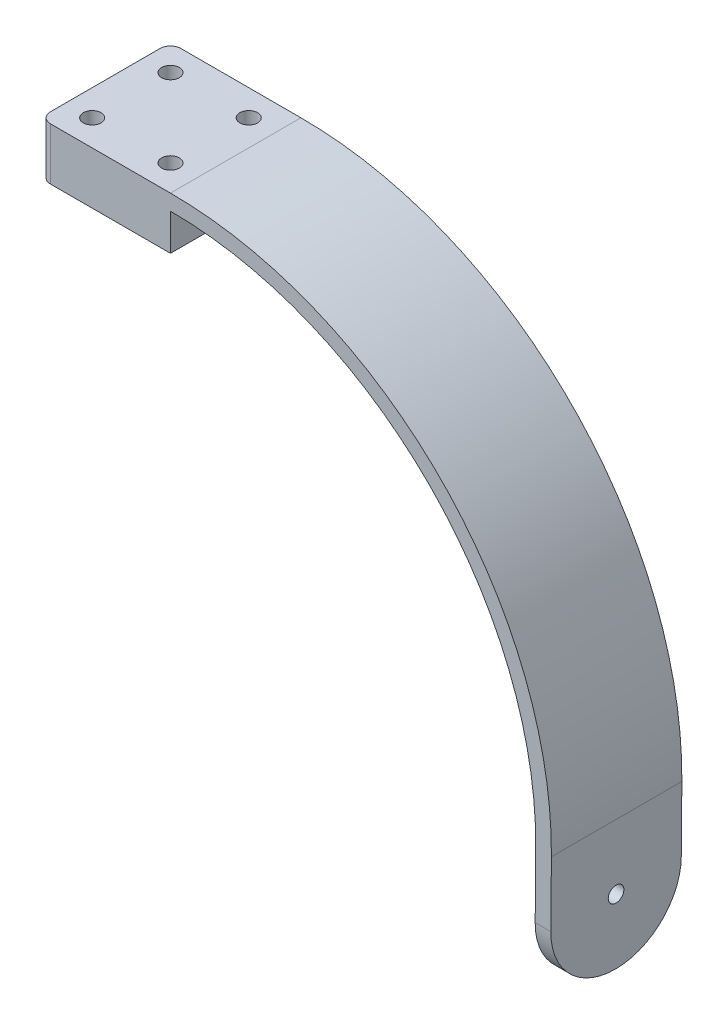
ISO-10303-21;
HEADER;
FILE_DESCRIPTION(('STEP AP214'),'2;1');
FILE_NAME('part.step','',(''),(''),'','','');
FILE_SCHEMA(('AUTOMOTIVE_DESIGN { 1 0 10303 214 1 1 1 1 }'));
ENDSEC;
DATA;
#1=APPLICATION_CONTEXT('core data for automotive mechanical design processes');
#2=APPLICATION_PROTOCOL_DEFINITION('international standard','automotive_design',2000,#1);
#3=PRODUCT_CONTEXT('',#1,'mechanical');
#4=PRODUCT('Part','Part','',(#3));
#5=PRODUCT_RELATED_PRODUCT_CATEGORY('part','',(#4));
#6=PRODUCT_DEFINITION_FORMATION('','',#4);
#7=PRODUCT_DEFINITION_CONTEXT('part definition',#1,'design');
#8=PRODUCT_DEFINITION('design','',#6,#7);
#9=PRODUCT_DEFINITION_SHAPE('','',#8);
#10=(LENGTH_UNIT() NAMED_UNIT(*) SI_UNIT(.MILLI.,.METRE.));
#11=(NAMED_UNIT(*) PLANE_ANGLE_UNIT() SI_UNIT($,.RADIAN.));
#12=(NAMED_UNIT(*) SI_UNIT($,.STERADIAN.) SOLID_ANGLE_UNIT());
#13=UNCERTAINTY_MEASURE_WITH_UNIT(LENGTH_MEASURE(1.E-05),#10,'distance_accuracy_value','');
#14=(GEOMETRIC_REPRESENTATION_CONTEXT(3) GLOBAL_UNCERTAINTY_ASSIGNED_CONTEXT((#13)) GLOBAL_UNIT_ASSIGNED_CONTEXT((#10,
#11,#12)) REPRESENTATION_CONTEXT('',''));
#15=CARTESIAN_POINT('',(0.,0.,0.));
#16=DIRECTION('',(0.,0.,1.));
#17=DIRECTION('',(1.,0.,0.));
#18=AXIS2_PLACEMENT_3D('',#15,#16,#17);
#19=CARTESIAN_POINT('',(0.,0.,25.));
#20=DIRECTION('',(0.,0.,-1.));
#21=DIRECTION('',(-1.,0.,0.));
#22=AXIS2_PLACEMENT_3D('',#19,#20,#21);
#23=CYLINDRICAL_SURFACE('',#22,70.);
#24=CARTESIAN_POINT('',(0.,0.,0.));
#25=DIRECTION('',(0.,0.,-1.));
#26=DIRECTION('',(-1.,0.,0.));
#27=AXIS2_PLACEMENT_3D('',#24,#25,#26);
#28=CIRCLE('',#27,70.);
#29=CARTESIAN_POINT('',(0.,70.,0.));
#30=VERTEX_POINT('',#29);
#31=CARTESIAN_POINT('',(69.997334614492,-0.610857484886409,0.));
#32=VERTEX_POINT('',#31);
#33=EDGE_CURVE('E152',#30,#32,#28,.T.);
#34=ORIENTED_EDGE('',*,*,#33,.T.);
#35=DIRECTION('',(0.,0.,-1.));
#36=VECTOR('',#35,1.);
#37=CARTESIAN_POINT('',(69.997334614492,-0.610857484886409,25.));
#38=LINE('',#37,#36);
#39=CARTESIAN_POINT('',(69.997334614492,-0.610857484886409,25.));
#40=VERTEX_POINT('',#39);
#41=EDGE_CURVE('E227',#40,#32,#38,.T.);
#42=ORIENTED_EDGE('',*,*,#41,.F.);
#43=CARTESIAN_POINT('',(0.,0.,25.));
#44=DIRECTION('',(0.,0.,-1.));
#45=DIRECTION('',(-1.,0.,0.));
#46=AXIS2_PLACEMENT_3D('',#43,#44,#45);
#47=CIRCLE('',#46,70.);
#48=CARTESIAN_POINT('',(0.,70.,25.));
#49=VERTEX_POINT('',#48);
#50=EDGE_CURVE('E180',#49,#40,#47,.T.);
#51=ORIENTED_EDGE('',*,*,#50,.F.);
#52=DIRECTION('',(0.,0.,-1.));
#53=VECTOR('',#52,1.);
#54=CARTESIAN_POINT('',(0.,70.,25.));
#55=LINE('',#54,#53);
#56=EDGE_CURVE('E199',#49,#30,#55,.T.);
#57=ORIENTED_EDGE('',*,*,#56,.T.);
#58=EDGE_LOOP('',(#34,#42,#51,#57));
#59=FACE_BOUND('',#58,.T.);
#60=ADVANCED_FACE('F45',(#59),#23,.F.);
#61=CARTESIAN_POINT('',(69.997334614492,-0.610857484886409,25.));
#62=DIRECTION('',(0.999961923064171,-0.00872653549837676,0.));
#63=DIRECTION('',(0.00872653549837677,0.999961923064171,0.));
#64=AXIS2_PLACEMENT_3D('',#61,#62,#63);
#65=PLANE('',#64);
#66=CARTESIAN_POINT('',(69.8882529207623,-13.1103815231885,12.5));
#67=DIRECTION('',(0.999961923064171,-0.00872653549837676,0.));
#68=DIRECTION('',(0.00872653549837677,0.999961923064171,0.));
#69=AXIS2_PLACEMENT_3D('',#66,#67,#68);
#70=CIRCLE('',#69,1.5);
#71=CARTESIAN_POINT('',(69.9013427240098,-11.6104386385922,12.5));
#72=VERTEX_POINT('',#71);
#73=EDGE_CURVE('E176',#72,#72,#70,.F.);
#74=ORIENTED_EDGE('',*,*,#73,.F.);
#75=EDGE_LOOP('',(#74));
#76=FACE_BOUND('',#75,.T.);
#77=DIRECTION('',(-0.00872653549837676,-0.999961923064171,0.));
#78=VECTOR('',#77,1.);
#79=CARTESIAN_POINT('',(69.997334614492,-0.610857484886409,0.));
#80=LINE('',#79,#78);
#81=CARTESIAN_POINT('',(69.8882529207623,-13.1103815231885,0.));
#82=VERTEX_POINT('',#81);
#83=EDGE_CURVE('E202',#32,#82,#80,.T.);
#84=ORIENTED_EDGE('',*,*,#83,.T.);
#85=CARTESIAN_POINT('',(69.8882529207623,-13.1103815231885,12.5));
#86=DIRECTION('',(0.999961923064171,-0.00872653549837676,0.));
#87=DIRECTION('',(0.00872653549837677,0.999961923064171,0.));
#88=AXIS2_PLACEMENT_3D('',#85,#86,#87);
#89=CIRCLE('',#88,12.5);
#90=CARTESIAN_POINT('',(69.7791712270326,-25.6099055614907,12.5));
#91=VERTEX_POINT('',#90);
#92=EDGE_CURVE('E244',#82,#91,#89,.F.);
#93=ORIENTED_EDGE('',*,*,#92,.T.);
#94=CARTESIAN_POINT('',(69.8882529207623,-13.1103815231886,12.5));
#95=DIRECTION('',(0.999961923064171,-0.00872653549837676,0.));
#96=DIRECTION('',(0.00872653549837677,0.999961923064171,0.));
#97=AXIS2_PLACEMENT_3D('',#94,#95,#96);
#98=CIRCLE('',#97,12.5);
#99=CARTESIAN_POINT('',(69.8882529207623,-13.1103815231885,25.));
#100=VERTEX_POINT('',#99);
#101=EDGE_CURVE('E241',#91,#100,#98,.F.);
#102=ORIENTED_EDGE('',*,*,#101,.T.);
#103=DIRECTION('',(-0.00872653549837676,-0.999961923064171,0.));
#104=VECTOR('',#103,1.);
#105=CARTESIAN_POINT('',(69.997334614492,-0.610857484886409,25.));
#106=LINE('',#105,#104);
#107=EDGE_CURVE('E184',#40,#100,#106,.T.);
#108=ORIENTED_EDGE('',*,*,#107,.F.);
#109=ORIENTED_EDGE('',*,*,#41,.T.);
#110=EDGE_LOOP('',(#84,#93,#102,#108,#109));
#111=FACE_BOUND('',#110,.T.);
#112=ADVANCED_FACE('F333',(#76,#111),#65,.F.);
#113=CARTESIAN_POINT('',(72.7790569962251,-25.6360851679858,25.));
#114=DIRECTION('',(-0.999961923064171,0.00872653549837676,0.));
#115=DIRECTION('',(-0.00872653549837676,-0.999961923064171,0.));
#116=AXIS2_PLACEMENT_3D('',#113,#114,#115);
#117=PLANE('',#116);
#118=CARTESIAN_POINT('',(72.8881386899548,-13.1365611296836,12.5));
#119=DIRECTION('',(0.999961923064171,-0.00872653549837746,0.));
#120=DIRECTION('',(0.00872653549837746,0.999961923064171,0.));
#121=AXIS2_PLACEMENT_3D('',#118,#119,#120);
#122=CIRCLE('',#121,1.5);
#123=CARTESIAN_POINT('',(72.9012284932023,-11.6366182450874,12.5));
#124=VERTEX_POINT('',#123);
#125=EDGE_CURVE('E172',#124,#124,#122,.T.);
#126=ORIENTED_EDGE('',*,*,#125,.F.);
#127=EDGE_LOOP('',(#126));
#128=FACE_BOUND('',#127,.T.);
#129=CARTESIAN_POINT('',(72.8881386899548,-13.1365611296837,12.5));
#130=DIRECTION('',(-0.999961923064171,0.00872653549837676,0.));
#131=DIRECTION('',(-0.00872653549837676,-0.999961923064171,0.));
#132=AXIS2_PLACEMENT_3D('',#129,#130,#131);
#133=CIRCLE('',#132,12.5);
#134=CARTESIAN_POINT('',(72.8881386899548,-13.1365611296837,25.));
#135=VERTEX_POINT('',#134);
#136=CARTESIAN_POINT('',(72.7790569962251,-25.6360851679858,12.5));
#137=VERTEX_POINT('',#136);
#138=EDGE_CURVE('E231',#135,#137,#133,.F.);
#139=ORIENTED_EDGE('',*,*,#138,.T.);
#140=CARTESIAN_POINT('',(72.8881386899548,-13.1365611296837,12.5));
#141=DIRECTION('',(-0.999961923064171,0.00872653549837676,0.));
#142=DIRECTION('',(-0.00872653549837676,-0.999961923064171,0.));
#143=AXIS2_PLACEMENT_3D('',#140,#141,#142);
#144=CIRCLE('',#143,12.5);
#145=CARTESIAN_POINT('',(72.8881386899548,-13.1365611296837,0.));
#146=VERTEX_POINT('',#145);
#147=EDGE_CURVE('E234',#137,#146,#144,.F.);
#148=ORIENTED_EDGE('',*,*,#147,.T.);
#149=DIRECTION('',(0.00872653549837676,0.999961923064171,0.));
#150=VECTOR('',#149,1.);
#151=CARTESIAN_POINT('',(72.7790569962251,-25.6360851679858,0.));
#152=LINE('',#151,#150);
#153=CARTESIAN_POINT('',(72.9972203836845,-0.637037091381508,0.));
#154=VERTEX_POINT('',#153);
#155=EDGE_CURVE('E206',#146,#154,#152,.T.);
#156=ORIENTED_EDGE('',*,*,#155,.T.);
#157=DIRECTION('',(0.,0.,-1.));
#158=VECTOR('',#157,1.);
#159=CARTESIAN_POINT('',(72.9972203836845,-0.637037091381508,25.));
#160=LINE('',#159,#158);
#161=CARTESIAN_POINT('',(72.9972203836845,-0.637037091381508,25.));
#162=VERTEX_POINT('',#161);
#163=EDGE_CURVE('E223',#162,#154,#160,.T.);
#164=ORIENTED_EDGE('',*,*,#163,.F.);
#165=DIRECTION('',(0.00872653549837676,0.999961923064171,0.));
#166=VECTOR('',#165,1.);
#167=CARTESIAN_POINT('',(72.7790569962251,-25.6360851679858,25.));
#168=LINE('',#167,#166);
#169=EDGE_CURVE('E189',#135,#162,#168,.T.);
#170=ORIENTED_EDGE('',*,*,#169,.F.);
#171=EDGE_LOOP('',(#139,#148,#156,#164,#170));
#172=FACE_BOUND('',#171,.T.);
#173=ADVANCED_FACE('F338',(#128,#172),#117,.F.);
#174=CARTESIAN_POINT('',(0.,0.,25.));
#175=DIRECTION('',(0.,0.,-1.));
#176=DIRECTION('',(-1.,0.,0.));
#177=AXIS2_PLACEMENT_3D('',#174,#175,#176);
#178=CYLINDRICAL_SURFACE('',#177,73.);
#179=CARTESIAN_POINT('',(0.,0.,0.));
#180=DIRECTION('',(0.,0.,1.));
#181=DIRECTION('',(-1.,0.,0.));
#182=AXIS2_PLACEMENT_3D('',#179,#180,#181);
#183=CIRCLE('',#182,73.);
#184=CARTESIAN_POINT('',(0.,73.,0.));
#185=VERTEX_POINT('',#184);
#186=EDGE_CURVE('E209',#154,#185,#183,.T.);
#187=ORIENTED_EDGE('',*,*,#186,.T.);
#188=DIRECTION('',(0.,0.,-1.));
#189=VECTOR('',#188,1.);
#190=CARTESIAN_POINT('',(0.,73.,25.));
#191=LINE('',#190,#189);
#192=CARTESIAN_POINT('',(0.,73.,25.));
#193=VERTEX_POINT('',#192);
#194=EDGE_CURVE('E219',#193,#185,#191,.T.);
#195=ORIENTED_EDGE('',*,*,#194,.F.);
#196=CARTESIAN_POINT('',(0.,0.,25.));
#197=DIRECTION('',(0.,0.,1.));
#198=DIRECTION('',(-1.,0.,0.));
#199=AXIS2_PLACEMENT_3D('',#196,#197,#198);
#200=CIRCLE('',#199,73.);
#201=EDGE_CURVE('E192',#162,#193,#200,.T.);
#202=ORIENTED_EDGE('',*,*,#201,.F.);
#203=ORIENTED_EDGE('',*,*,#163,.T.);
#204=EDGE_LOOP('',(#187,#195,#202,#203));
#205=FACE_BOUND('',#204,.T.);
#206=ADVANCED_FACE('F322',(#205),#178,.T.);
#207=CARTESIAN_POINT('',(0.,73.,25.));
#208=DIRECTION('',(0.,-1.,0.));
#209=DIRECTION('',(0.,0.,-1.));
#210=AXIS2_PLACEMENT_3D('',#207,#208,#209);
#211=PLANE('',#210);
#212=CARTESIAN_POINT('',(-20.,73.,5.));
#213=DIRECTION('',(0.,1.,0.));
#214=DIRECTION('',(0.,0.,1.));
#215=AXIS2_PLACEMENT_3D('',#212,#213,#214);
#216=CIRCLE('',#215,1.69999999999999);
#217=CARTESIAN_POINT('',(-20.,73.,6.69999999999999));
#218=VERTEX_POINT('',#217);
#219=EDGE_CURVE('E298',#218,#218,#216,.T.);
#220=ORIENTED_EDGE('',*,*,#219,.F.);
#221=EDGE_LOOP('',(#220));
#222=FACE_BOUND('',#221,.T.);
#223=CARTESIAN_POINT('',(-5.,73.,20.));
#224=DIRECTION('',(0.,1.,0.));
#225=DIRECTION('',(0.,0.,1.));
#226=AXIS2_PLACEMENT_3D('',#223,#224,#225);
#227=CIRCLE('',#226,1.69999999999999);
#228=CARTESIAN_POINT('',(-5.,73.,21.7));
#229=VERTEX_POINT('',#228);
#230=EDGE_CURVE('E285',#229,#229,#227,.T.);
#231=ORIENTED_EDGE('',*,*,#230,.F.);
#232=EDGE_LOOP('',(#231));
#233=FACE_BOUND('',#232,.T.);
#234=CARTESIAN_POINT('',(-20.,73.,20.));
#235=DIRECTION('',(0.,1.,0.));
#236=DIRECTION('',(0.,0.,1.));
#237=AXIS2_PLACEMENT_3D('',#234,#235,#236);
#238=CIRCLE('',#237,1.69999999999999);
#239=CARTESIAN_POINT('',(-20.,73.,21.7));
#240=VERTEX_POINT('',#239);
#241=EDGE_CURVE('E281',#240,#240,#238,.T.);
#242=ORIENTED_EDGE('',*,*,#241,.F.);
#243=EDGE_LOOP('',(#242));
#244=FACE_BOUND('',#243,.T.);
#245=CARTESIAN_POINT('',(-5.,73.,5.));
#246=DIRECTION('',(0.,1.,0.));
#247=DIRECTION('',(0.,0.,1.));
#248=AXIS2_PLACEMENT_3D('',#245,#246,#247);
#249=CIRCLE('',#248,1.69999999999999);
#250=CARTESIAN_POINT('',(-5.,73.,6.69999999999999));
#251=VERTEX_POINT('',#250);
#252=EDGE_CURVE('E277',#251,#251,#249,.T.);
#253=ORIENTED_EDGE('',*,*,#252,.F.);
#254=EDGE_LOOP('',(#253));
#255=FACE_BOUND('',#254,.T.);
#256=DIRECTION('',(0.,0.,-1.));
#257=VECTOR('',#256,1.);
#258=CARTESIAN_POINT('',(-25.,73.,25.));
#259=LINE('',#258,#257);
#260=CARTESIAN_POINT('',(-25.,73.,23.));
#261=VERTEX_POINT('',#260);
#262=CARTESIAN_POINT('',(-25.,73.,2.));
#263=VERTEX_POINT('',#262);
#264=EDGE_CURVE('E216',#261,#263,#259,.T.);
#265=ORIENTED_EDGE('',*,*,#264,.F.);
#266=CARTESIAN_POINT('',(-23.,73.,23.));
#267=DIRECTION('',(0.,-1.,0.));
#268=DIRECTION('',(0.,0.,-1.));
#269=AXIS2_PLACEMENT_3D('',#266,#267,#268);
#270=CIRCLE('',#269,2.);
#271=CARTESIAN_POINT('',(-23.,73.,25.));
#272=VERTEX_POINT('',#271);
#273=EDGE_CURVE('E55',#261,#272,#270,.F.);
#274=ORIENTED_EDGE('',*,*,#273,.T.);
#275=DIRECTION('',(-1.,0.,0.));
#276=VECTOR('',#275,1.);
#277=CARTESIAN_POINT('',(0.,73.,25.));
#278=LINE('',#277,#276);
#279=EDGE_CURVE('E195',#193,#272,#278,.T.);
#280=ORIENTED_EDGE('',*,*,#279,.F.);
#281=ORIENTED_EDGE('',*,*,#194,.T.);
#282=DIRECTION('',(-1.,0.,0.));
#283=VECTOR('',#282,1.);
#284=CARTESIAN_POINT('',(0.,73.,0.));
#285=LINE('',#284,#283);
#286=CARTESIAN_POINT('',(-23.,73.,0.));
#287=VERTEX_POINT('',#286);
#288=EDGE_CURVE('E185',#185,#287,#285,.T.);
#289=ORIENTED_EDGE('',*,*,#288,.T.);
#290=CARTESIAN_POINT('',(-23.,73.,2.));
#291=DIRECTION('',(0.,-1.,0.));
#292=DIRECTION('',(0.,0.,-1.));
#293=AXIS2_PLACEMENT_3D('',#290,#291,#292);
#294=CIRCLE('',#293,2.);
#295=EDGE_CURVE('E68',#287,#263,#294,.F.);
#296=ORIENTED_EDGE('',*,*,#295,.T.);
#297=EDGE_LOOP('',(#265,#274,#280,#281,#289,#296));
#298=FACE_BOUND('',#297,.T.);
#299=ADVANCED_FACE('F314',(#222,#233,#244,#255,#298),#211,.F.);
#300=CARTESIAN_POINT('',(-25.,73.,25.));
#301=DIRECTION('',(1.,0.,0.));
#302=DIRECTION('',(0.,0.,-1.));
#303=AXIS2_PLACEMENT_3D('',#300,#301,#302);
#304=PLANE('',#303);
#305=DIRECTION('',(0.,0.,-1.));
#306=VECTOR('',#305,1.);
#307=CARTESIAN_POINT('',(-25.,63.,25.));
#308=LINE('',#307,#306);
#309=CARTESIAN_POINT('',(-25.,63.,23.));
#310=VERTEX_POINT('',#309);
#311=CARTESIAN_POINT('',(-25.,63.,2.));
#312=VERTEX_POINT('',#311);
#313=EDGE_CURVE('E146',#310,#312,#308,.T.);
#314=ORIENTED_EDGE('',*,*,#313,.F.);
#315=DIRECTION('',(0.,-1.,0.));
#316=VECTOR('',#315,1.);
#317=CARTESIAN_POINT('',(-25.,73.,23.));
#318=LINE('',#317,#316);
#319=EDGE_CURVE('E266',#310,#261,#318,.F.);
#320=ORIENTED_EDGE('',*,*,#319,.T.);
#321=ORIENTED_EDGE('',*,*,#264,.T.);
#322=DIRECTION('',(0.,-1.,0.));
#323=VECTOR('',#322,1.);
#324=CARTESIAN_POINT('',(-25.,63.,2.));
#325=LINE('',#324,#323);
#326=EDGE_CURVE('E262',#263,#312,#325,.T.);
#327=ORIENTED_EDGE('',*,*,#326,.T.);
#328=EDGE_LOOP('',(#314,#320,#321,#327));
#329=FACE_BOUND('',#328,.T.);
#330=ADVANCED_FACE('F307',(#329),#304,.F.);
#331=CARTESIAN_POINT('',(0.,0.,25.));
#332=DIRECTION('',(0.,0.,-1.));
#333=DIRECTION('',(-1.,0.,0.));
#334=AXIS2_PLACEMENT_3D('',#331,#332,#333);
#335=PLANE('',#334);
#336=ORIENTED_EDGE('',*,*,#279,.T.);
#337=DIRECTION('',(0.,-1.,0.));
#338=VECTOR('',#337,1.);
#339=CARTESIAN_POINT('',(-23.,0.,25.));
#340=LINE('',#339,#338);
#341=CARTESIAN_POINT('',(-23.,63.,25.));
#342=VERTEX_POINT('',#341);
#343=EDGE_CURVE('E250',#272,#342,#340,.T.);
#344=ORIENTED_EDGE('',*,*,#343,.T.);
#345=DIRECTION('',(-1.,0.,0.));
#346=VECTOR('',#345,1.);
#347=CARTESIAN_POINT('',(-25.,63.,25.));
#348=LINE('',#347,#346);
#349=CARTESIAN_POINT('',(0.,63.,25.));
#350=VERTEX_POINT('',#349);
#351=EDGE_CURVE('E164',#350,#342,#348,.T.);
#352=ORIENTED_EDGE('',*,*,#351,.F.);
#353=DIRECTION('',(0.,1.,0.));
#354=VECTOR('',#353,1.);
#355=CARTESIAN_POINT('',(0.,63.,25.));
#356=LINE('',#355,#354);
#357=EDGE_CURVE('E158',#350,#49,#356,.T.);
#358=ORIENTED_EDGE('',*,*,#357,.T.);
#359=ORIENTED_EDGE('',*,*,#50,.T.);
#360=ORIENTED_EDGE('',*,*,#107,.T.);
#361=DIRECTION('',(0.999961923064171,-0.00872653549837543,0.));
#362=VECTOR('',#361,1.);
#363=CARTESIAN_POINT('',(-0.109081693729694,-12.4995240383023,25.));
#364=LINE('',#363,#362);
#365=EDGE_CURVE('E247',#100,#135,#364,.T.);
#366=ORIENTED_EDGE('',*,*,#365,.T.);
#367=ORIENTED_EDGE('',*,*,#169,.T.);
#368=ORIENTED_EDGE('',*,*,#201,.T.);
#369=EDGE_LOOP('',(#336,#344,#352,#358,#359,#360,#366,#367,#368));
#370=FACE_BOUND('',#369,.T.);
#371=ADVANCED_FACE('F316',(#370),#335,.F.);
#372=CARTESIAN_POINT('',(0.,0.,0.));
#373=DIRECTION('',(0.,0.,-1.));
#374=DIRECTION('',(-1.,0.,0.));
#375=AXIS2_PLACEMENT_3D('',#372,#373,#374);
#376=PLANE('',#375);
#377=DIRECTION('',(1.,0.,0.));
#378=VECTOR('',#377,1.);
#379=CARTESIAN_POINT('',(-25.,63.,0.));
#380=LINE('',#379,#378);
#381=CARTESIAN_POINT('',(-23.,63.,0.));
#382=VERTEX_POINT('',#381);
#383=CARTESIAN_POINT('',(0.,63.,0.));
#384=VERTEX_POINT('',#383);
#385=EDGE_CURVE('E136',#382,#384,#380,.T.);
#386=ORIENTED_EDGE('',*,*,#385,.F.);
#387=DIRECTION('',(0.,-1.,0.));
#388=VECTOR('',#387,1.);
#389=CARTESIAN_POINT('',(-23.,73.,0.));
#390=LINE('',#389,#388);
#391=EDGE_CURVE('E11',#382,#287,#390,.F.);
#392=ORIENTED_EDGE('',*,*,#391,.T.);
#393=ORIENTED_EDGE('',*,*,#288,.F.);
#394=ORIENTED_EDGE('',*,*,#186,.F.);
#395=ORIENTED_EDGE('',*,*,#155,.F.);
#396=DIRECTION('',(0.999961923064171,-0.00872653549837543,0.));
#397=VECTOR('',#396,1.);
#398=CARTESIAN_POINT('',(69.8882529207623,-13.1103815231885,0.));
#399=LINE('',#398,#397);
#400=EDGE_CURVE('E237',#146,#82,#399,.F.);
#401=ORIENTED_EDGE('',*,*,#400,.T.);
#402=ORIENTED_EDGE('',*,*,#83,.F.);
#403=ORIENTED_EDGE('',*,*,#33,.F.);
#404=DIRECTION('',(0.,1.,0.));
#405=VECTOR('',#404,1.);
#406=CARTESIAN_POINT('',(0.,63.,0.));
#407=LINE('',#406,#405);
#408=EDGE_CURVE('E149',#384,#30,#407,.T.);
#409=ORIENTED_EDGE('',*,*,#408,.F.);
#410=EDGE_LOOP('',(#386,#392,#393,#394,#395,#401,#402,#403,#409));
#411=FACE_BOUND('',#410,.T.);
#412=ADVANCED_FACE('F150',(#411),#376,.T.);
#413=CARTESIAN_POINT('',(-25.7451993681965,-12.2758010286886,12.5));
#414=DIRECTION('',(0.999961923064171,-0.00872653549837746,0.));
#415=DIRECTION('',(0.00872653549837746,0.999961923064171,0.));
#416=AXIS2_PLACEMENT_3D('',#413,#414,#415);
#417=CYLINDRICAL_SURFACE('',#416,1.5);
#418=ORIENTED_EDGE('',*,*,#125,.T.);
#419=EDGE_LOOP('',(#418));
#420=FACE_BOUND('',#419,.T.);
#421=ORIENTED_EDGE('',*,*,#73,.T.);
#422=EDGE_LOOP('',(#421));
#423=FACE_BOUND('',#422,.T.);
#424=ADVANCED_FACE('F360',(#420,#423),#417,.F.);
#425=CARTESIAN_POINT('',(-0.109081693729694,-12.4995240383023,12.5));
#426=DIRECTION('',(0.999961923064171,-0.00872653549837543,0.));
#427=DIRECTION('',(0.00872653549837543,0.999961923064171,0.));
#428=AXIS2_PLACEMENT_3D('',#425,#426,#427);
#429=CYLINDRICAL_SURFACE('',#428,12.5);
#430=ORIENTED_EDGE('',*,*,#365,.F.);
#431=ORIENTED_EDGE('',*,*,#101,.F.);
#432=DIRECTION('',(0.999961923064171,-0.00872653549837543,0.));
#433=VECTOR('',#432,1.);
#434=CARTESIAN_POINT('',(69.7791712270326,-25.6099055614907,12.5));
#435=LINE('',#434,#433);
#436=EDGE_CURVE('E157',#137,#91,#435,.F.);
#437=ORIENTED_EDGE('',*,*,#436,.F.);
#438=ORIENTED_EDGE('',*,*,#138,.F.);
#439=EDGE_LOOP('',(#430,#431,#437,#438));
#440=FACE_BOUND('',#439,.T.);
#441=ADVANCED_FACE('F336',(#440),#429,.T.);
#442=CARTESIAN_POINT('',(69.8882529207623,-13.1103815231885,12.5));
#443=DIRECTION('',(-0.999961923064171,0.00872653549837543,0.));
#444=DIRECTION('',(-0.00872653549837543,-0.999961923064171,0.));
#445=AXIS2_PLACEMENT_3D('',#442,#443,#444);
#446=CYLINDRICAL_SURFACE('',#445,12.5);
#447=ORIENTED_EDGE('',*,*,#92,.F.);
#448=ORIENTED_EDGE('',*,*,#400,.F.);
#449=ORIENTED_EDGE('',*,*,#147,.F.);
#450=ORIENTED_EDGE('',*,*,#436,.T.);
#451=EDGE_LOOP('',(#447,#448,#449,#450));
#452=FACE_BOUND('',#451,.T.);
#453=ADVANCED_FACE('F329',(#452),#446,.T.);
#454=CARTESIAN_POINT('',(0.,63.,25.));
#455=DIRECTION('',(-1.,0.,0.));
#456=DIRECTION('',(0.,0.,1.));
#457=AXIS2_PLACEMENT_3D('',#454,#455,#456);
#458=PLANE('',#457);
#459=ORIENTED_EDGE('',*,*,#56,.F.);
#460=ORIENTED_EDGE('',*,*,#357,.F.);
#461=DIRECTION('',(0.,0.,1.));
#462=VECTOR('',#461,1.);
#463=CARTESIAN_POINT('',(0.,63.,25.));
#464=LINE('',#463,#462);
#465=EDGE_CURVE('E141',#384,#350,#464,.T.);
#466=ORIENTED_EDGE('',*,*,#465,.F.);
#467=ORIENTED_EDGE('',*,*,#408,.T.);
#468=EDGE_LOOP('',(#459,#460,#466,#467));
#469=FACE_BOUND('',#468,.T.);
#470=ADVANCED_FACE('F160',(#469),#458,.F.);
#471=CARTESIAN_POINT('',(0.,63.,0.));
#472=DIRECTION('',(0.,-1.,0.));
#473=DIRECTION('',(0.,0.,-1.));
#474=AXIS2_PLACEMENT_3D('',#471,#472,#473);
#475=PLANE('',#474);
#476=CARTESIAN_POINT('',(-20.,63.,5.));
#477=DIRECTION('',(0.,-1.,0.));
#478=DIRECTION('',(0.,0.,-1.));
#479=AXIS2_PLACEMENT_3D('',#476,#477,#478);
#480=CIRCLE('',#479,1.69999999999998);
#481=CARTESIAN_POINT('',(-20.,63.,3.30000000000002));
#482=VERTEX_POINT('',#481);
#483=EDGE_CURVE('E49',#482,#482,#480,.T.);
#484=ORIENTED_EDGE('',*,*,#483,.F.);
#485=EDGE_LOOP('',(#484));
#486=FACE_BOUND('',#485,.T.);
#487=CARTESIAN_POINT('',(-5.,63.,20.));
#488=DIRECTION('',(0.,-1.,0.));
#489=DIRECTION('',(0.,0.,-1.));
#490=AXIS2_PLACEMENT_3D('',#487,#488,#489);
#491=CIRCLE('',#490,1.69999999999998);
#492=CARTESIAN_POINT('',(-5.,63.,18.3));
#493=VERTEX_POINT('',#492);
#494=EDGE_CURVE('E282',#493,#493,#491,.T.);
#495=ORIENTED_EDGE('',*,*,#494,.F.);
#496=EDGE_LOOP('',(#495));
#497=FACE_BOUND('',#496,.T.);
#498=CARTESIAN_POINT('',(-20.,63.,20.));
#499=DIRECTION('',(0.,-1.,0.));
#500=DIRECTION('',(0.,0.,-1.));
#501=AXIS2_PLACEMENT_3D('',#498,#499,#500);
#502=CIRCLE('',#501,1.69999999999998);
#503=CARTESIAN_POINT('',(-20.,63.,18.3));
#504=VERTEX_POINT('',#503);
#505=EDGE_CURVE('E278',#504,#504,#502,.T.);
#506=ORIENTED_EDGE('',*,*,#505,.F.);
#507=EDGE_LOOP('',(#506));
#508=FACE_BOUND('',#507,.T.);
#509=CARTESIAN_POINT('',(-5.,63.,5.));
#510=DIRECTION('',(0.,-1.,0.));
#511=DIRECTION('',(0.,0.,-1.));
#512=AXIS2_PLACEMENT_3D('',#509,#510,#511);
#513=CIRCLE('',#512,1.69999999999998);
#514=CARTESIAN_POINT('',(-5.,63.,3.30000000000001));
#515=VERTEX_POINT('',#514);
#516=EDGE_CURVE('E273',#515,#515,#513,.T.);
#517=ORIENTED_EDGE('',*,*,#516,.F.);
#518=EDGE_LOOP('',(#517));
#519=FACE_BOUND('',#518,.T.);
#520=ORIENTED_EDGE('',*,*,#351,.T.);
#521=CARTESIAN_POINT('',(-23.,63.,23.));
#522=DIRECTION('',(0.,-1.,0.));
#523=DIRECTION('',(0.,0.,-1.));
#524=AXIS2_PLACEMENT_3D('',#521,#522,#523);
#525=CIRCLE('',#524,2.);
#526=EDGE_CURVE('E259',#342,#310,#525,.T.);
#527=ORIENTED_EDGE('',*,*,#526,.T.);
#528=ORIENTED_EDGE('',*,*,#313,.T.);
#529=CARTESIAN_POINT('',(-23.,63.,2.));
#530=DIRECTION('',(0.,-1.,0.));
#531=DIRECTION('',(0.,0.,-1.));
#532=AXIS2_PLACEMENT_3D('',#529,#530,#531);
#533=CIRCLE('',#532,2.);
#534=EDGE_CURVE('E144',#312,#382,#533,.T.);
#535=ORIENTED_EDGE('',*,*,#534,.T.);
#536=ORIENTED_EDGE('',*,*,#385,.T.);
#537=ORIENTED_EDGE('',*,*,#465,.T.);
#538=EDGE_LOOP('',(#520,#527,#528,#535,#536,#537));
#539=FACE_BOUND('',#538,.T.);
#540=ADVANCED_FACE('F139',(#486,#497,#508,#519,#539),#475,.T.);
#541=CARTESIAN_POINT('',(-23.,0.,23.));
#542=DIRECTION('',(0.,-1.,0.));
#543=DIRECTION('',(0.,0.,-1.));
#544=AXIS2_PLACEMENT_3D('',#541,#542,#543);
#545=CYLINDRICAL_SURFACE('',#544,2.);
#546=ORIENTED_EDGE('',*,*,#273,.F.);
#547=ORIENTED_EDGE('',*,*,#319,.F.);
#548=ORIENTED_EDGE('',*,*,#526,.F.);
#549=ORIENTED_EDGE('',*,*,#343,.F.);
#550=EDGE_LOOP('',(#546,#547,#548,#549));
#551=FACE_BOUND('',#550,.T.);
#552=ADVANCED_FACE('F311',(#551),#545,.T.);
#553=CARTESIAN_POINT('',(-23.,73.,2.));
#554=DIRECTION('',(0.,1.,0.));
#555=DIRECTION('',(0.,0.,1.));
#556=AXIS2_PLACEMENT_3D('',#553,#554,#555);
#557=CYLINDRICAL_SURFACE('',#556,2.);
#558=ORIENTED_EDGE('',*,*,#295,.F.);
#559=ORIENTED_EDGE('',*,*,#391,.F.);
#560=ORIENTED_EDGE('',*,*,#534,.F.);
#561=ORIENTED_EDGE('',*,*,#326,.F.);
#562=EDGE_LOOP('',(#558,#559,#560,#561));
#563=FACE_BOUND('',#562,.T.);
#564=ADVANCED_FACE('F47',(#563),#557,.T.);
#565=CARTESIAN_POINT('',(-5.,73.,5.));
#566=DIRECTION('',(0.,1.,0.));
#567=DIRECTION('',(0.,0.,1.));
#568=AXIS2_PLACEMENT_3D('',#565,#566,#567);
#569=CYLINDRICAL_SURFACE('',#568,1.69999999999998);
#570=ORIENTED_EDGE('',*,*,#516,.T.);
#571=EDGE_LOOP('',(#570));
#572=FACE_BOUND('',#571,.T.);
#573=ORIENTED_EDGE('',*,*,#252,.T.);
#574=EDGE_LOOP('',(#573));
#575=FACE_BOUND('',#574,.T.);
#576=ADVANCED_FACE('F366',(#572,#575),#569,.F.);
#577=CARTESIAN_POINT('',(-20.,73.,20.));
#578=DIRECTION('',(0.,1.,0.));
#579=DIRECTION('',(0.,0.,1.));
#580=AXIS2_PLACEMENT_3D('',#577,#578,#579);
#581=CYLINDRICAL_SURFACE('',#580,1.69999999999998);
#582=ORIENTED_EDGE('',*,*,#505,.T.);
#583=EDGE_LOOP('',(#582));
#584=FACE_BOUND('',#583,.T.);
#585=ORIENTED_EDGE('',*,*,#241,.T.);
#586=EDGE_LOOP('',(#585));
#587=FACE_BOUND('',#586,.T.);
#588=ADVANCED_FACE('F400',(#584,#587),#581,.F.);
#589=CARTESIAN_POINT('',(-5.,73.,20.));
#590=DIRECTION('',(0.,1.,0.));
#591=DIRECTION('',(0.,0.,1.));
#592=AXIS2_PLACEMENT_3D('',#589,#590,#591);
#593=CYLINDRICAL_SURFACE('',#592,1.69999999999998);
#594=ORIENTED_EDGE('',*,*,#494,.T.);
#595=EDGE_LOOP('',(#594));
#596=FACE_BOUND('',#595,.T.);
#597=ORIENTED_EDGE('',*,*,#230,.T.);
#598=EDGE_LOOP('',(#597));
#599=FACE_BOUND('',#598,.T.);
#600=ADVANCED_FACE('F405',(#596,#599),#593,.F.);
#601=CARTESIAN_POINT('',(-20.,73.,5.));
#602=DIRECTION('',(0.,1.,0.));
#603=DIRECTION('',(0.,0.,1.));
#604=AXIS2_PLACEMENT_3D('',#601,#602,#603);
#605=CYLINDRICAL_SURFACE('',#604,1.69999999999998);
#606=ORIENTED_EDGE('',*,*,#483,.T.);
#607=EDGE_LOOP('',(#606));
#608=FACE_BOUND('',#607,.T.);
#609=ORIENTED_EDGE('',*,*,#219,.T.);
#610=EDGE_LOOP('',(#609));
#611=FACE_BOUND('',#610,.T.);
#612=ADVANCED_FACE('F412',(#608,#611),#605,.F.);
#613=CLOSED_SHELL('',(#60,#112,#173,#206,#299,#330,#371,#412,#424,#441,#453,#470,#540,#552,#564,
#576,#588,#600,#612));
#614=MANIFOLD_SOLID_BREP('B2',#613);
#615=ADVANCED_BREP_SHAPE_REPRESENTATION('',(#18,#614),#14);
#616=SHAPE_DEFINITION_REPRESENTATION(#9,#615);
ENDSEC;
END-ISO-10303-21;
